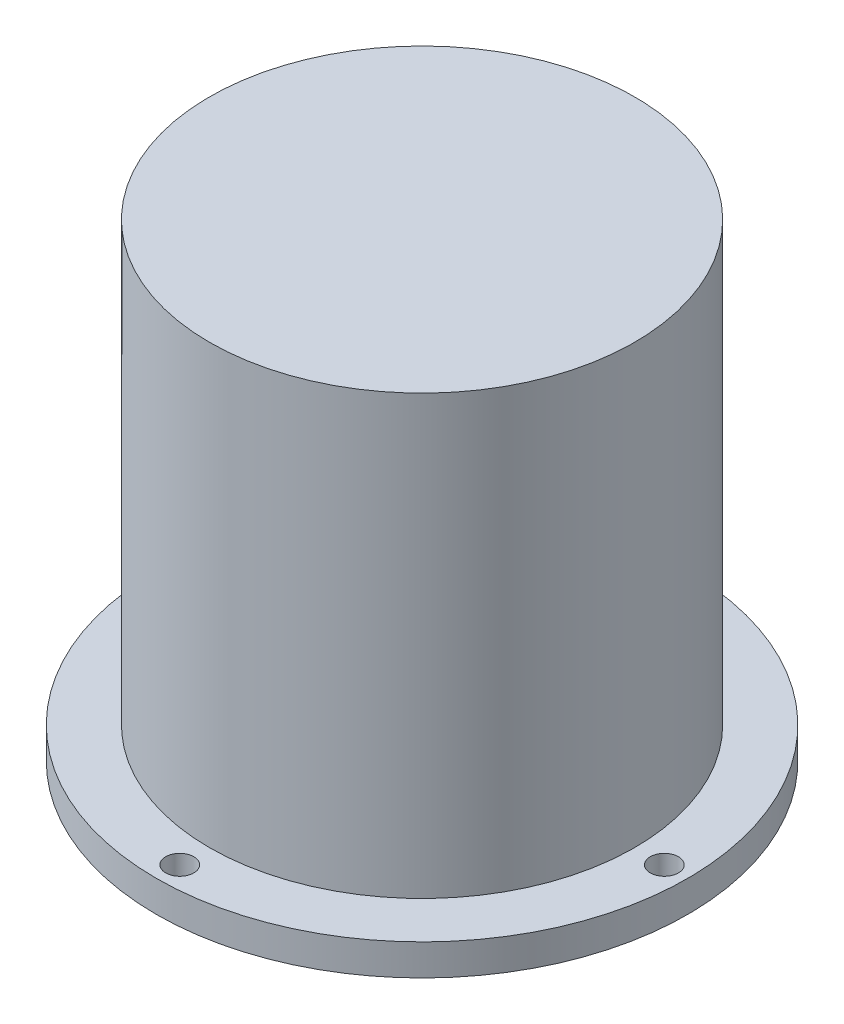
ISO-10303-21;
HEADER;
FILE_DESCRIPTION(('STEP AP214'),'2;1');
FILE_NAME('part.step','',(''),(''),'','','');
FILE_SCHEMA(('AUTOMOTIVE_DESIGN { 1 0 10303 214 1 1 1 1 }'));
ENDSEC;
DATA;
#1=APPLICATION_CONTEXT('core data for automotive mechanical design processes');
#2=APPLICATION_PROTOCOL_DEFINITION('international standard','automotive_design',2000,#1);
#3=PRODUCT_CONTEXT('',#1,'mechanical');
#4=PRODUCT('Part','Part','',(#3));
#5=PRODUCT_RELATED_PRODUCT_CATEGORY('part','',(#4));
#6=PRODUCT_DEFINITION_FORMATION('','',#4);
#7=PRODUCT_DEFINITION_CONTEXT('part definition',#1,'design');
#8=PRODUCT_DEFINITION('design','',#6,#7);
#9=PRODUCT_DEFINITION_SHAPE('','',#8);
#10=(LENGTH_UNIT() NAMED_UNIT(*) SI_UNIT(.MILLI.,.METRE.));
#11=(NAMED_UNIT(*) PLANE_ANGLE_UNIT() SI_UNIT($,.RADIAN.));
#12=(NAMED_UNIT(*) SI_UNIT($,.STERADIAN.) SOLID_ANGLE_UNIT());
#13=UNCERTAINTY_MEASURE_WITH_UNIT(LENGTH_MEASURE(1.E-05),#10,'distance_accuracy_value','');
#14=(GEOMETRIC_REPRESENTATION_CONTEXT(3) GLOBAL_UNCERTAINTY_ASSIGNED_CONTEXT((#13)) GLOBAL_UNIT_ASSIGNED_CONTEXT((#10,
#11,#12)) REPRESENTATION_CONTEXT('',''));
#15=CARTESIAN_POINT('',(0.,0.,0.));
#16=DIRECTION('',(0.,0.,1.));
#17=DIRECTION('',(1.,0.,0.));
#18=AXIS2_PLACEMENT_3D('',#15,#16,#17);
#19=CARTESIAN_POINT('',(0.,5.,0.));
#20=DIRECTION('',(0.,-1.,0.));
#21=DIRECTION('',(0.,0.,-1.));
#22=AXIS2_PLACEMENT_3D('',#19,#20,#21);
#23=CYLINDRICAL_SURFACE('',#22,42.5);
#24=CARTESIAN_POINT('',(0.,5.,0.));
#25=DIRECTION('',(0.,1.,0.));
#26=DIRECTION('',(0.,0.,1.));
#27=AXIS2_PLACEMENT_3D('',#24,#25,#26);
#28=CIRCLE('',#27,42.5);
#29=CARTESIAN_POINT('',(0.,5.,42.5));
#30=VERTEX_POINT('',#29);
#31=EDGE_CURVE('E10',#30,#30,#28,.T.);
#32=ORIENTED_EDGE('',*,*,#31,.F.);
#33=EDGE_LOOP('',(#32));
#34=FACE_BOUND('',#33,.T.);
#35=CARTESIAN_POINT('',(0.,0.,0.));
#36=DIRECTION('',(0.,1.,0.));
#37=DIRECTION('',(0.,0.,1.));
#38=AXIS2_PLACEMENT_3D('',#35,#36,#37);
#39=CIRCLE('',#38,42.5);
#40=CARTESIAN_POINT('',(0.,0.,42.5));
#41=VERTEX_POINT('',#40);
#42=EDGE_CURVE('E34',#41,#41,#39,.T.);
#43=ORIENTED_EDGE('',*,*,#42,.T.);
#44=EDGE_LOOP('',(#43));
#45=FACE_BOUND('',#44,.T.);
#46=ADVANCED_FACE('F31',(#34,#45),#23,.T.);
#47=CARTESIAN_POINT('',(0.,5.,0.));
#48=DIRECTION('',(0.,1.,0.));
#49=DIRECTION('',(0.,0.,1.));
#50=AXIS2_PLACEMENT_3D('',#47,#48,#49);
#51=PLANE('',#50);
#52=CARTESIAN_POINT('',(0.,5.,0.));
#53=DIRECTION('',(0.,1.,0.));
#54=DIRECTION('',(0.,0.,1.));
#55=AXIS2_PLACEMENT_3D('',#52,#53,#54);
#56=CIRCLE('',#55,34.);
#57=CARTESIAN_POINT('',(0.,5.,34.));
#58=VERTEX_POINT('',#57);
#59=EDGE_CURVE('E67',#58,#58,#56,.T.);
#60=ORIENTED_EDGE('',*,*,#59,.F.);
#61=EDGE_LOOP('',(#60));
#62=FACE_BOUND('',#61,.T.);
#63=CARTESIAN_POINT('',(0.,5.,-38.75));
#64=DIRECTION('',(0.,1.,0.));
#65=DIRECTION('',(0.,0.,1.));
#66=AXIS2_PLACEMENT_3D('',#63,#64,#65);
#67=CIRCLE('',#66,2.24999999999999);
#68=CARTESIAN_POINT('',(0.,5.,-36.5));
#69=VERTEX_POINT('',#68);
#70=EDGE_CURVE('E63',#69,#69,#67,.T.);
#71=ORIENTED_EDGE('',*,*,#70,.F.);
#72=EDGE_LOOP('',(#71));
#73=FACE_BOUND('',#72,.T.);
#74=CARTESIAN_POINT('',(-38.75,5.,0.));
#75=DIRECTION('',(0.,1.,0.));
#76=DIRECTION('',(0.,0.,1.));
#77=AXIS2_PLACEMENT_3D('',#74,#75,#76);
#78=CIRCLE('',#77,2.24999999999999);
#79=CARTESIAN_POINT('',(-38.75,5.,2.24999999999999));
#80=VERTEX_POINT('',#79);
#81=EDGE_CURVE('E57',#80,#80,#78,.T.);
#82=ORIENTED_EDGE('',*,*,#81,.F.);
#83=EDGE_LOOP('',(#82));
#84=FACE_BOUND('',#83,.T.);
#85=CARTESIAN_POINT('',(0.,5.,38.75));
#86=DIRECTION('',(0.,1.,0.));
#87=DIRECTION('',(0.,0.,1.));
#88=AXIS2_PLACEMENT_3D('',#85,#86,#87);
#89=CIRCLE('',#88,2.24999999999999);
#90=CARTESIAN_POINT('',(0.,5.,41.));
#91=VERTEX_POINT('',#90);
#92=EDGE_CURVE('E51',#91,#91,#89,.T.);
#93=ORIENTED_EDGE('',*,*,#92,.F.);
#94=EDGE_LOOP('',(#93));
#95=FACE_BOUND('',#94,.T.);
#96=CARTESIAN_POINT('',(38.75,5.,0.));
#97=DIRECTION('',(0.,1.,0.));
#98=DIRECTION('',(0.,0.,1.));
#99=AXIS2_PLACEMENT_3D('',#96,#97,#98);
#100=CIRCLE('',#99,2.24999999999999);
#101=CARTESIAN_POINT('',(38.75,5.,2.24999999999999));
#102=VERTEX_POINT('',#101);
#103=EDGE_CURVE('E45',#102,#102,#100,.T.);
#104=ORIENTED_EDGE('',*,*,#103,.F.);
#105=EDGE_LOOP('',(#104));
#106=FACE_BOUND('',#105,.T.);
#107=ORIENTED_EDGE('',*,*,#31,.T.);
#108=EDGE_LOOP('',(#107));
#109=FACE_BOUND('',#108,.T.);
#110=ADVANCED_FACE('F82',(#62,#73,#84,#95,#106,#109),#51,.T.);
#111=CARTESIAN_POINT('',(0.,0.,0.));
#112=DIRECTION('',(0.,1.,0.));
#113=DIRECTION('',(0.,0.,1.));
#114=AXIS2_PLACEMENT_3D('',#111,#112,#113);
#115=PLANE('',#114);
#116=CARTESIAN_POINT('',(0.,0.,-38.75));
#117=DIRECTION('',(0.,1.,0.));
#118=DIRECTION('',(0.,0.,1.));
#119=AXIS2_PLACEMENT_3D('',#116,#117,#118);
#120=CIRCLE('',#119,2.24999999999999);
#121=CARTESIAN_POINT('',(0.,0.,-36.5));
#122=VERTEX_POINT('',#121);
#123=EDGE_CURVE('E60',#122,#122,#120,.T.);
#124=ORIENTED_EDGE('',*,*,#123,.T.);
#125=EDGE_LOOP('',(#124));
#126=FACE_BOUND('',#125,.T.);
#127=CARTESIAN_POINT('',(-38.75,0.,0.));
#128=DIRECTION('',(0.,1.,0.));
#129=DIRECTION('',(0.,0.,1.));
#130=AXIS2_PLACEMENT_3D('',#127,#128,#129);
#131=CIRCLE('',#130,2.24999999999999);
#132=CARTESIAN_POINT('',(-38.75,0.,2.24999999999999));
#133=VERTEX_POINT('',#132);
#134=EDGE_CURVE('E54',#133,#133,#131,.T.);
#135=ORIENTED_EDGE('',*,*,#134,.T.);
#136=EDGE_LOOP('',(#135));
#137=FACE_BOUND('',#136,.T.);
#138=CARTESIAN_POINT('',(0.,0.,38.75));
#139=DIRECTION('',(0.,1.,0.));
#140=DIRECTION('',(0.,0.,1.));
#141=AXIS2_PLACEMENT_3D('',#138,#139,#140);
#142=CIRCLE('',#141,2.24999999999999);
#143=CARTESIAN_POINT('',(0.,0.,41.));
#144=VERTEX_POINT('',#143);
#145=EDGE_CURVE('E48',#144,#144,#142,.T.);
#146=ORIENTED_EDGE('',*,*,#145,.T.);
#147=EDGE_LOOP('',(#146));
#148=FACE_BOUND('',#147,.T.);
#149=CARTESIAN_POINT('',(38.75,0.,0.));
#150=DIRECTION('',(0.,1.,0.));
#151=DIRECTION('',(0.,0.,1.));
#152=AXIS2_PLACEMENT_3D('',#149,#150,#151);
#153=CIRCLE('',#152,2.24999999999999);
#154=CARTESIAN_POINT('',(38.75,0.,2.24999999999999));
#155=VERTEX_POINT('',#154);
#156=EDGE_CURVE('E41',#155,#155,#153,.T.);
#157=ORIENTED_EDGE('',*,*,#156,.T.);
#158=EDGE_LOOP('',(#157));
#159=FACE_BOUND('',#158,.T.);
#160=ORIENTED_EDGE('',*,*,#42,.F.);
#161=EDGE_LOOP('',(#160));
#162=FACE_BOUND('',#161,.T.);
#163=ADVANCED_FACE('F85',(#126,#137,#148,#159,#162),#115,.F.);
#164=CARTESIAN_POINT('',(38.75,5.,0.));
#165=DIRECTION('',(0.,1.,0.));
#166=DIRECTION('',(0.,0.,1.));
#167=AXIS2_PLACEMENT_3D('',#164,#165,#166);
#168=CYLINDRICAL_SURFACE('',#167,2.24999999999999);
#169=ORIENTED_EDGE('',*,*,#156,.F.);
#170=EDGE_LOOP('',(#169));
#171=FACE_BOUND('',#170,.T.);
#172=ORIENTED_EDGE('',*,*,#103,.T.);
#173=EDGE_LOOP('',(#172));
#174=FACE_BOUND('',#173,.T.);
#175=ADVANCED_FACE('F95',(#171,#174),#168,.F.);
#176=CARTESIAN_POINT('',(0.,5.,38.75));
#177=DIRECTION('',(0.,1.,0.));
#178=DIRECTION('',(0.,0.,1.));
#179=AXIS2_PLACEMENT_3D('',#176,#177,#178);
#180=CYLINDRICAL_SURFACE('',#179,2.24999999999999);
#181=ORIENTED_EDGE('',*,*,#145,.F.);
#182=EDGE_LOOP('',(#181));
#183=FACE_BOUND('',#182,.T.);
#184=ORIENTED_EDGE('',*,*,#92,.T.);
#185=EDGE_LOOP('',(#184));
#186=FACE_BOUND('',#185,.T.);
#187=ADVANCED_FACE('F97',(#183,#186),#180,.F.);
#188=CARTESIAN_POINT('',(-38.75,5.,0.));
#189=DIRECTION('',(0.,1.,0.));
#190=DIRECTION('',(0.,0.,1.));
#191=AXIS2_PLACEMENT_3D('',#188,#189,#190);
#192=CYLINDRICAL_SURFACE('',#191,2.24999999999999);
#193=ORIENTED_EDGE('',*,*,#134,.F.);
#194=EDGE_LOOP('',(#193));
#195=FACE_BOUND('',#194,.T.);
#196=ORIENTED_EDGE('',*,*,#81,.T.);
#197=EDGE_LOOP('',(#196));
#198=FACE_BOUND('',#197,.T.);
#199=ADVANCED_FACE('F104',(#195,#198),#192,.F.);
#200=CARTESIAN_POINT('',(0.,5.,-38.75));
#201=DIRECTION('',(0.,1.,0.));
#202=DIRECTION('',(0.,0.,1.));
#203=AXIS2_PLACEMENT_3D('',#200,#201,#202);
#204=CYLINDRICAL_SURFACE('',#203,2.24999999999999);
#205=ORIENTED_EDGE('',*,*,#123,.F.);
#206=EDGE_LOOP('',(#205));
#207=FACE_BOUND('',#206,.T.);
#208=ORIENTED_EDGE('',*,*,#70,.T.);
#209=EDGE_LOOP('',(#208));
#210=FACE_BOUND('',#209,.T.);
#211=ADVANCED_FACE('F78',(#207,#210),#204,.F.);
#212=CARTESIAN_POINT('',(0.,75.,0.));
#213=DIRECTION('',(0.,-1.,0.));
#214=DIRECTION('',(0.,0.,-1.));
#215=AXIS2_PLACEMENT_3D('',#212,#213,#214);
#216=CYLINDRICAL_SURFACE('',#215,34.);
#217=CARTESIAN_POINT('',(0.,75.,0.));
#218=DIRECTION('',(0.,1.,0.));
#219=DIRECTION('',(0.,0.,1.));
#220=AXIS2_PLACEMENT_3D('',#217,#218,#219);
#221=CIRCLE('',#220,34.);
#222=CARTESIAN_POINT('',(0.,75.,34.));
#223=VERTEX_POINT('',#222);
#224=EDGE_CURVE('E66',#223,#223,#221,.T.);
#225=ORIENTED_EDGE('',*,*,#224,.F.);
#226=EDGE_LOOP('',(#225));
#227=FACE_BOUND('',#226,.T.);
#228=ORIENTED_EDGE('',*,*,#59,.T.);
#229=EDGE_LOOP('',(#228));
#230=FACE_BOUND('',#229,.T.);
#231=ADVANCED_FACE('F75',(#227,#230),#216,.T.);
#232=CARTESIAN_POINT('',(0.,75.,0.));
#233=DIRECTION('',(0.,1.,0.));
#234=DIRECTION('',(0.,0.,1.));
#235=AXIS2_PLACEMENT_3D('',#232,#233,#234);
#236=PLANE('',#235);
#237=ORIENTED_EDGE('',*,*,#224,.T.);
#238=EDGE_LOOP('',(#237));
#239=FACE_BOUND('',#238,.T.);
#240=ADVANCED_FACE('F73',(#239),#236,.T.);
#241=CLOSED_SHELL('',(#46,#110,#163,#175,#187,#199,#211,#231,#240));
#242=MANIFOLD_SOLID_BREP('B2',#241);
#243=ADVANCED_BREP_SHAPE_REPRESENTATION('',(#18,#242),#14);
#244=SHAPE_DEFINITION_REPRESENTATION(#9,#243);
ENDSEC;
END-ISO-10303-21;
